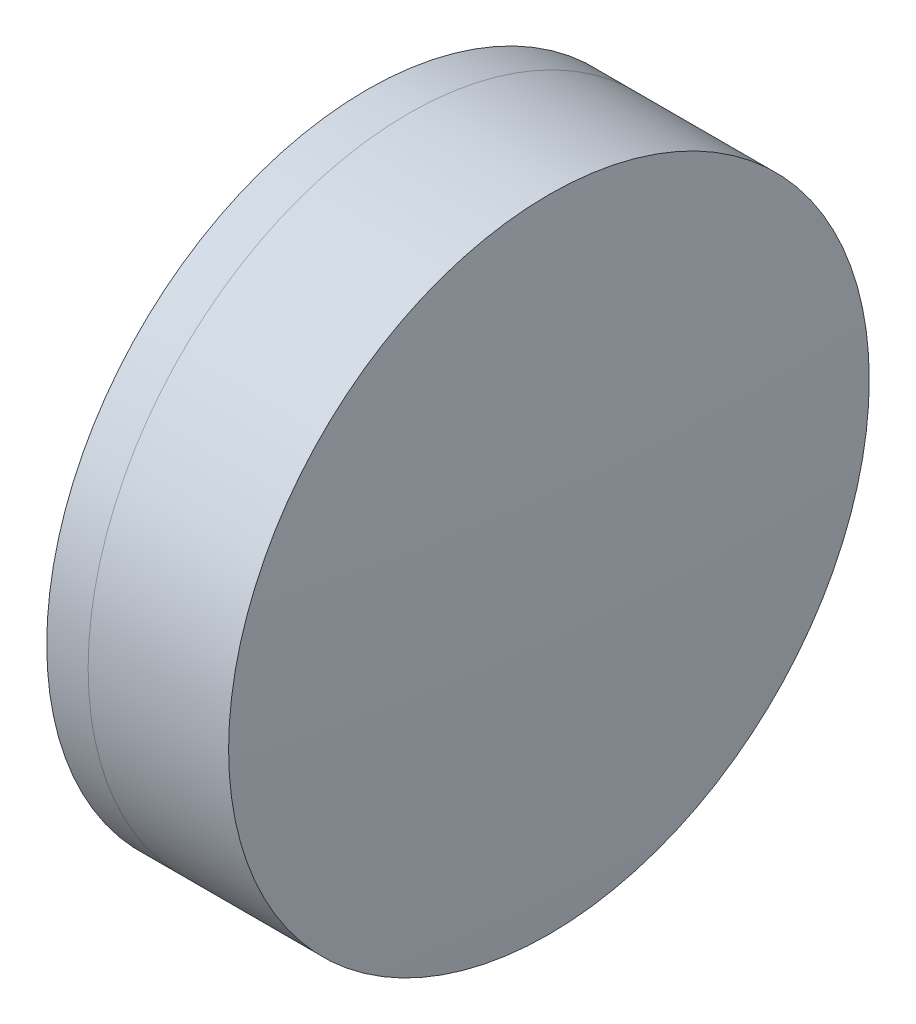
ISO-10303-21;
HEADER;
FILE_DESCRIPTION(('STEP AP214'),'2;1');
FILE_NAME('part.step','',(''),(''),'','','');
FILE_SCHEMA(('AUTOMOTIVE_DESIGN { 1 0 10303 214 1 1 1 1 }'));
ENDSEC;
DATA;
#1=APPLICATION_CONTEXT('core data for automotive mechanical design processes');
#2=APPLICATION_PROTOCOL_DEFINITION('international standard','automotive_design',2000,#1);
#3=PRODUCT_CONTEXT('',#1,'mechanical');
#4=PRODUCT('Part','Part','',(#3));
#5=PRODUCT_RELATED_PRODUCT_CATEGORY('part','',(#4));
#6=PRODUCT_DEFINITION_FORMATION('','',#4);
#7=PRODUCT_DEFINITION_CONTEXT('part definition',#1,'design');
#8=PRODUCT_DEFINITION('design','',#6,#7);
#9=PRODUCT_DEFINITION_SHAPE('','',#8);
#10=(LENGTH_UNIT() NAMED_UNIT(*) SI_UNIT(.MILLI.,.METRE.));
#11=(NAMED_UNIT(*) PLANE_ANGLE_UNIT() SI_UNIT($,.RADIAN.));
#12=(NAMED_UNIT(*) SI_UNIT($,.STERADIAN.) SOLID_ANGLE_UNIT());
#13=UNCERTAINTY_MEASURE_WITH_UNIT(LENGTH_MEASURE(1.E-05),#10,'distance_accuracy_value','');
#14=(GEOMETRIC_REPRESENTATION_CONTEXT(3) GLOBAL_UNCERTAINTY_ASSIGNED_CONTEXT((#13)) GLOBAL_UNIT_ASSIGNED_CONTEXT((#10,
#11,#12)) REPRESENTATION_CONTEXT('',''));
#15=CARTESIAN_POINT('',(0.,0.,0.));
#16=DIRECTION('',(0.,0.,1.));
#17=DIRECTION('',(1.,0.,0.));
#18=AXIS2_PLACEMENT_3D('',#15,#16,#17);
#19=CARTESIAN_POINT('',(269.41091660723,0.,0.));
#20=DIRECTION('',(-1.,0.,0.));
#21=DIRECTION('',(0.,0.,1.));
#22=AXIS2_PLACEMENT_3D('',#19,#20,#21);
#23=SPHERICAL_SURFACE('',#22,44.2000000000001);
#24=CARTESIAN_POINT('',(305.583834653747,0.,0.));
#25=DIRECTION('',(-1.,0.,0.));
#26=DIRECTION('',(0.,0.,1.));
#27=AXIS2_PLACEMENT_3D('',#24,#25,#26);
#28=CIRCLE('',#27,25.3999999999999);
#29=CARTESIAN_POINT('',(305.583834653747,0.,25.3999999999999));
#30=VERTEX_POINT('',#29);
#31=EDGE_CURVE('E11',#30,#30,#28,.T.);
#32=ORIENTED_EDGE('',*,*,#31,.T.);
#33=EDGE_LOOP('',(#32));
#34=FACE_BOUND('',#33,.T.);
#35=ADVANCED_FACE('F45',(#34),#23,.F.);
#36=CARTESIAN_POINT('',(-0.551919992657797,0.,0.));
#37=DIRECTION('',(-1.,0.,0.));
#38=DIRECTION('',(0.,0.,1.));
#39=AXIS2_PLACEMENT_3D('',#36,#37,#38);
#40=CYLINDRICAL_SURFACE('',#39,25.3999999999999);
#41=CARTESIAN_POINT('',(316.721421700608,0.,0.));
#42=DIRECTION('',(-1.,0.,0.));
#43=DIRECTION('',(0.,0.,1.));
#44=AXIS2_PLACEMENT_3D('',#41,#42,#43);
#45=CIRCLE('',#44,25.3999999999999);
#46=CARTESIAN_POINT('',(316.721421700608,0.,25.3999999999999));
#47=VERTEX_POINT('',#46);
#48=EDGE_CURVE('E51',#47,#47,#45,.T.);
#49=ORIENTED_EDGE('',*,*,#48,.T.);
#50=EDGE_LOOP('',(#49));
#51=FACE_BOUND('',#50,.T.);
#52=ORIENTED_EDGE('',*,*,#31,.F.);
#53=EDGE_LOOP('',(#52));
#54=FACE_BOUND('',#53,.T.);
#55=ADVANCED_FACE('F57',(#51,#54),#40,.T.);
#56=CARTESIAN_POINT('',(-45.4890833927699,0.,0.));
#57=DIRECTION('',(-1.,0.,0.));
#58=DIRECTION('',(0.,0.,1.));
#59=AXIS2_PLACEMENT_3D('',#56,#57,#58);
#60=SPHERICAL_SURFACE('',#59,363.1);
#61=ORIENTED_EDGE('',*,*,#48,.F.);
#62=EDGE_LOOP('',(#61));
#63=FACE_BOUND('',#62,.T.);
#64=ADVANCED_FACE('F60',(#63),#60,.T.);
#65=CLOSED_SHELL('',(#35,#55,#64));
#66=MANIFOLD_SOLID_BREP('B2',#65);
#67=CARTESIAN_POINT('',(368.71091660723,0.,-1.08485080675612E-13));
#68=DIRECTION('',(-1.,0.,0.));
#69=DIRECTION('',(0.,0.,1.));
#70=AXIS2_PLACEMENT_3D('',#67,#68,#69);
#71=SPHERICAL_SURFACE('',#70,71.1);
#72=CARTESIAN_POINT('',(302.302709283135,0.,0.));
#73=DIRECTION('',(-1.,0.,0.));
#74=DIRECTION('',(0.,0.,1.));
#75=AXIS2_PLACEMENT_3D('',#72,#73,#74);
#76=CIRCLE('',#75,25.4);
#77=CARTESIAN_POINT('',(302.302709283135,0.,25.4));
#78=VERTEX_POINT('',#77);
#79=EDGE_CURVE('E44',#78,#78,#76,.T.);
#80=ORIENTED_EDGE('',*,*,#79,.T.);
#81=EDGE_LOOP('',(#80));
#82=FACE_BOUND('',#81,.T.);
#83=ADVANCED_FACE('F86',(#82),#71,.T.);
#84=CARTESIAN_POINT('',(124.523309526045,0.,0.));
#85=DIRECTION('',(-1.,0.,0.));
#86=DIRECTION('',(0.,0.,1.));
#87=AXIS2_PLACEMENT_3D('',#84,#85,#86);
#88=CYLINDRICAL_SURFACE('',#87,25.4);
#89=CARTESIAN_POINT('',(305.583834653747,0.,0.));
#90=DIRECTION('',(-1.,0.,0.));
#91=DIRECTION('',(0.,0.,1.));
#92=AXIS2_PLACEMENT_3D('',#89,#90,#91);
#93=CIRCLE('',#92,25.4);
#94=CARTESIAN_POINT('',(305.583834653747,0.,25.4));
#95=VERTEX_POINT('',#94);
#96=EDGE_CURVE('E92',#95,#95,#93,.T.);
#97=ORIENTED_EDGE('',*,*,#96,.T.);
#98=EDGE_LOOP('',(#97));
#99=FACE_BOUND('',#98,.T.);
#100=ORIENTED_EDGE('',*,*,#79,.F.);
#101=EDGE_LOOP('',(#100));
#102=FACE_BOUND('',#101,.T.);
#103=ADVANCED_FACE('F98',(#99,#102),#88,.T.);
#104=CARTESIAN_POINT('',(269.41091660723,0.,0.));
#105=DIRECTION('',(-1.,0.,0.));
#106=DIRECTION('',(0.,0.,1.));
#107=AXIS2_PLACEMENT_3D('',#104,#105,#106);
#108=SPHERICAL_SURFACE('',#107,44.2000000000001);
#109=ORIENTED_EDGE('',*,*,#96,.F.);
#110=EDGE_LOOP('',(#109));
#111=FACE_BOUND('',#110,.T.);
#112=ADVANCED_FACE('F101',(#111),#108,.T.);
#113=CLOSED_SHELL('',(#83,#103,#112));
#114=MANIFOLD_SOLID_BREP('B6',#113);
#115=ADVANCED_BREP_SHAPE_REPRESENTATION('',(#18,#66,#114),#14);
#116=SHAPE_DEFINITION_REPRESENTATION(#9,#115);
ENDSEC;
END-ISO-10303-21;
